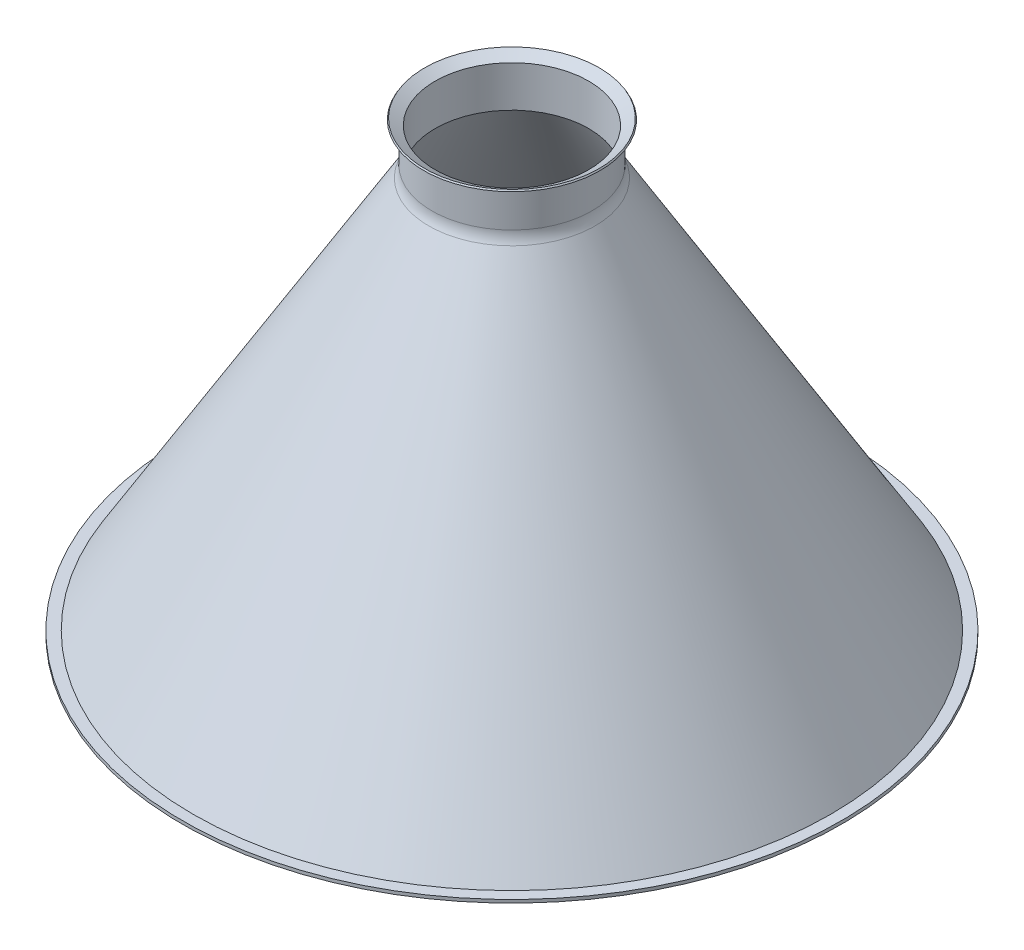
ISO-10303-21;
HEADER;
FILE_DESCRIPTION(('STEP AP214'),'2;1');
FILE_NAME('part.step','',(''),(''),'','','');
FILE_SCHEMA(('AUTOMOTIVE_DESIGN { 1 0 10303 214 1 1 1 1 }'));
ENDSEC;
DATA;
#1=APPLICATION_CONTEXT('core data for automotive mechanical design processes');
#2=APPLICATION_PROTOCOL_DEFINITION('international standard','automotive_design',2000,#1);
#3=PRODUCT_CONTEXT('',#1,'mechanical');
#4=PRODUCT('Part','Part','',(#3));
#5=PRODUCT_RELATED_PRODUCT_CATEGORY('part','',(#4));
#6=PRODUCT_DEFINITION_FORMATION('','',#4);
#7=PRODUCT_DEFINITION_CONTEXT('part definition',#1,'design');
#8=PRODUCT_DEFINITION('design','',#6,#7);
#9=PRODUCT_DEFINITION_SHAPE('','',#8);
#10=(LENGTH_UNIT() NAMED_UNIT(*) SI_UNIT(.MILLI.,.METRE.));
#11=(NAMED_UNIT(*) PLANE_ANGLE_UNIT() SI_UNIT($,.RADIAN.));
#12=(NAMED_UNIT(*) SI_UNIT($,.STERADIAN.) SOLID_ANGLE_UNIT());
#13=UNCERTAINTY_MEASURE_WITH_UNIT(LENGTH_MEASURE(1.E-05),#10,'distance_accuracy_value','');
#14=(GEOMETRIC_REPRESENTATION_CONTEXT(3) GLOBAL_UNCERTAINTY_ASSIGNED_CONTEXT((#13)) GLOBAL_UNIT_ASSIGNED_CONTEXT((#10,
#11,#12)) REPRESENTATION_CONTEXT('',''));
#15=CARTESIAN_POINT('',(0.,0.,0.));
#16=DIRECTION('',(0.,0.,1.));
#17=DIRECTION('',(1.,0.,0.));
#18=AXIS2_PLACEMENT_3D('',#15,#16,#17);
#19=CARTESIAN_POINT('',(0.,74.5394970830572,0.));
#20=DIRECTION('',(0.,1.,0.));
#21=DIRECTION('',(0.,0.,1.));
#22=AXIS2_PLACEMENT_3D('',#19,#20,#21);
#23=CONICAL_SURFACE('',#22,25.2615189104075,1.02957544582547);
#24=CARTESIAN_POINT('',(0.,76.0850453883371,0.));
#25=DIRECTION('',(0.,-1.,0.));
#26=DIRECTION('',(0.,0.,-1.));
#27=AXIS2_PLACEMENT_3D('',#24,#25,#26);
#28=CIRCLE('',#27,27.8327599407364);
#29=CARTESIAN_POINT('',(0.,76.0850453883371,-27.8327599407364));
#30=VERTEX_POINT('',#29);
#31=EDGE_CURVE('E44',#30,#30,#28,.T.);
#32=ORIENTED_EDGE('',*,*,#31,.T.);
#33=EDGE_LOOP('',(#32));
#34=FACE_BOUND('',#33,.T.);
#35=CARTESIAN_POINT('',(0.,74.5394970830572,0.));
#36=DIRECTION('',(0.,-1.,0.));
#37=DIRECTION('',(0.,0.,-1.));
#38=AXIS2_PLACEMENT_3D('',#35,#36,#37);
#39=CIRCLE('',#38,25.2615189104075);
#40=CARTESIAN_POINT('',(0.,74.5394970830572,-25.2615189104075));
#41=VERTEX_POINT('',#40);
#42=EDGE_CURVE('E71',#41,#41,#39,.T.);
#43=ORIENTED_EDGE('',*,*,#42,.F.);
#44=EDGE_LOOP('',(#43));
#45=FACE_BOUND('',#44,.T.);
#46=ADVANCED_FACE('F33',(#34,#45),#23,.T.);
#47=CARTESIAN_POINT('',(0.,76.0850453883371,0.));
#48=DIRECTION('',(0.,-1.,0.));
#49=DIRECTION('',(0.,0.,-1.));
#50=AXIS2_PLACEMENT_3D('',#47,#48,#49);
#51=CONICAL_SURFACE('',#50,27.8327599407364,0.541220880969439);
#52=CARTESIAN_POINT('',(0.,76.526598412436,0.));
#53=DIRECTION('',(0.,-1.,0.));
#54=DIRECTION('',(0.,0.,-1.));
#55=AXIS2_PLACEMENT_3D('',#52,#53,#54);
#56=CIRCLE('',#55,27.5673466558526);
#57=CARTESIAN_POINT('',(0.,76.526598412436,-27.5673466558526));
#58=VERTEX_POINT('',#57);
#59=EDGE_CURVE('E48',#58,#58,#56,.T.);
#60=ORIENTED_EDGE('',*,*,#59,.T.);
#61=EDGE_LOOP('',(#60));
#62=FACE_BOUND('',#61,.T.);
#63=ORIENTED_EDGE('',*,*,#31,.F.);
#64=EDGE_LOOP('',(#63));
#65=FACE_BOUND('',#64,.T.);
#66=ADVANCED_FACE('F78',(#62,#65),#51,.T.);
#67=CARTESIAN_POINT('',(0.,76.526598412436,0.));
#68=DIRECTION('',(0.,1.,0.));
#69=DIRECTION('',(0.,0.,1.));
#70=AXIS2_PLACEMENT_3D('',#67,#68,#69);
#71=CONICAL_SURFACE('',#70,27.5673466558526,1.02957544582547);
#72=CARTESIAN_POINT('',(0.,74.5394970830572,0.));
#73=DIRECTION('',(0.,-1.,0.));
#74=DIRECTION('',(0.,0.,-1.));
#75=AXIS2_PLACEMENT_3D('',#72,#73,#74);
#76=CIRCLE('',#75,24.2615189104075);
#77=CARTESIAN_POINT('',(0.,74.5394970830572,-24.2615189104075));
#78=VERTEX_POINT('',#77);
#79=EDGE_CURVE('E53',#78,#78,#76,.T.);
#80=ORIENTED_EDGE('',*,*,#79,.T.);
#81=EDGE_LOOP('',(#80));
#82=FACE_BOUND('',#81,.T.);
#83=ORIENTED_EDGE('',*,*,#59,.F.);
#84=EDGE_LOOP('',(#83));
#85=FACE_BOUND('',#84,.T.);
#86=ADVANCED_FACE('F83',(#82,#85),#71,.F.);
#87=CARTESIAN_POINT('',(0.,0.,0.));
#88=DIRECTION('',(0.,-1.,0.));
#89=DIRECTION('',(0.,0.,-1.));
#90=AXIS2_PLACEMENT_3D('',#87,#88,#89);
#91=CYLINDRICAL_SURFACE('',#90,24.2615189104075);
#92=CARTESIAN_POINT('',(0.,61.5620816388382,0.));
#93=DIRECTION('',(0.,-1.,0.));
#94=DIRECTION('',(0.,0.,-1.));
#95=AXIS2_PLACEMENT_3D('',#92,#93,#94);
#96=CIRCLE('',#95,24.2615189104075);
#97=CARTESIAN_POINT('',(0.,61.5620816388382,-24.2615189104075));
#98=VERTEX_POINT('',#97);
#99=EDGE_CURVE('E56',#98,#98,#96,.T.);
#100=ORIENTED_EDGE('',*,*,#99,.T.);
#101=EDGE_LOOP('',(#100));
#102=FACE_BOUND('',#101,.T.);
#103=ORIENTED_EDGE('',*,*,#79,.F.);
#104=EDGE_LOOP('',(#103));
#105=FACE_BOUND('',#104,.T.);
#106=ADVANCED_FACE('F89',(#102,#105),#91,.F.);
#107=CARTESIAN_POINT('',(0.,61.5620816388382,0.));
#108=DIRECTION('',(0.,-1.,0.));
#109=DIRECTION('',(0.,0.,-1.));
#110=AXIS2_PLACEMENT_3D('',#107,#108,#109);
#111=CONICAL_SURFACE('',#110,24.2615189104075,0.541220880969428);
#112=CARTESIAN_POINT('',(0.,-64.5435766878914,0.));
#113=DIRECTION('',(0.,-1.,0.));
#114=DIRECTION('',(0.,0.,-1.));
#115=AXIS2_PLACEMENT_3D('',#112,#113,#114);
#116=CIRCLE('',#115,100.062419803838);
#117=CARTESIAN_POINT('',(0.,-64.5435766878914,-100.062419803838));
#118=VERTEX_POINT('',#117);
#119=EDGE_CURVE('E59',#118,#118,#116,.T.);
#120=ORIENTED_EDGE('',*,*,#119,.T.);
#121=EDGE_LOOP('',(#120));
#122=FACE_BOUND('',#121,.T.);
#123=ORIENTED_EDGE('',*,*,#99,.F.);
#124=EDGE_LOOP('',(#123));
#125=FACE_BOUND('',#124,.T.);
#126=ADVANCED_FACE('F93',(#122,#125),#111,.F.);
#127=CARTESIAN_POINT('',(100.062419803838,-64.5435766878914,0.));
#128=DIRECTION('',(0.,-1.,0.));
#129=DIRECTION('',(0.,0.,-1.));
#130=AXIS2_PLACEMENT_3D('',#127,#128,#129);
#131=PLANE('',#130);
#132=CARTESIAN_POINT('',(0.,-64.5435766878914,0.));
#133=DIRECTION('',(0.,-1.,0.));
#134=DIRECTION('',(0.,0.,-1.));
#135=AXIS2_PLACEMENT_3D('',#132,#133,#134);
#136=CIRCLE('',#135,104.062419803838);
#137=CARTESIAN_POINT('',(0.,-64.5435766878914,-104.062419803838));
#138=VERTEX_POINT('',#137);
#139=EDGE_CURVE('E62',#138,#138,#136,.T.);
#140=ORIENTED_EDGE('',*,*,#139,.T.);
#141=EDGE_LOOP('',(#140));
#142=FACE_BOUND('',#141,.T.);
#143=ORIENTED_EDGE('',*,*,#119,.F.);
#144=EDGE_LOOP('',(#143));
#145=FACE_BOUND('',#144,.T.);
#146=ADVANCED_FACE('F97',(#142,#145),#131,.T.);
#147=CARTESIAN_POINT('',(0.,0.,0.));
#148=DIRECTION('',(0.,-1.,0.));
#149=DIRECTION('',(0.,0.,-1.));
#150=AXIS2_PLACEMENT_3D('',#147,#148,#149);
#151=CYLINDRICAL_SURFACE('',#150,104.062419803838);
#152=CARTESIAN_POINT('',(0.,-63.5435766878914,0.));
#153=DIRECTION('',(0.,-1.,0.));
#154=DIRECTION('',(0.,0.,-1.));
#155=AXIS2_PLACEMENT_3D('',#152,#153,#154);
#156=CIRCLE('',#155,104.062419803838);
#157=CARTESIAN_POINT('',(0.,-63.5435766878914,-104.062419803838));
#158=VERTEX_POINT('',#157);
#159=EDGE_CURVE('E65',#158,#158,#156,.T.);
#160=ORIENTED_EDGE('',*,*,#159,.T.);
#161=EDGE_LOOP('',(#160));
#162=FACE_BOUND('',#161,.T.);
#163=ORIENTED_EDGE('',*,*,#139,.F.);
#164=EDGE_LOOP('',(#163));
#165=FACE_BOUND('',#164,.T.);
#166=ADVANCED_FACE('F101',(#162,#165),#151,.T.);
#167=CARTESIAN_POINT('',(104.062419803838,-63.5435766878913,0.));
#168=DIRECTION('',(0.,1.,0.));
#169=DIRECTION('',(0.,0.,1.));
#170=AXIS2_PLACEMENT_3D('',#167,#168,#169);
#171=PLANE('',#170);
#172=CARTESIAN_POINT('',(0.,-63.5435766878913,0.));
#173=DIRECTION('',(0.,-1.,0.));
#174=DIRECTION('',(0.,0.,-1.));
#175=AXIS2_PLACEMENT_3D('',#172,#173,#174);
#176=CIRCLE('',#175,100.628081162522);
#177=CARTESIAN_POINT('',(0.,-63.5435766878913,-100.628081162522));
#178=VERTEX_POINT('',#177);
#179=EDGE_CURVE('E68',#178,#178,#176,.T.);
#180=ORIENTED_EDGE('',*,*,#179,.T.);
#181=EDGE_LOOP('',(#180));
#182=FACE_BOUND('',#181,.T.);
#183=ORIENTED_EDGE('',*,*,#159,.F.);
#184=EDGE_LOOP('',(#183));
#185=FACE_BOUND('',#184,.T.);
#186=ADVANCED_FACE('F105',(#182,#185),#171,.T.);
#187=CARTESIAN_POINT('',(0.,-63.5435766878913,0.));
#188=DIRECTION('',(0.,-1.,0.));
#189=DIRECTION('',(0.,0.,-1.));
#190=AXIS2_PLACEMENT_3D('',#187,#188,#189);
#191=CONICAL_SURFACE('',#190,100.628081162522,0.541220880969428);
#192=CARTESIAN_POINT('',(0.,60.1751258136039,0.));
#193=DIRECTION('',(0.,-1.,0.));
#194=DIRECTION('',(0.,0.,-1.));
#195=AXIS2_PLACEMENT_3D('',#192,#193,#194);
#196=CIRCLE('',#195,26.2619565063069);
#197=CARTESIAN_POINT('',(0.,60.1751258136039,-26.2619565063069));
#198=VERTEX_POINT('',#197);
#199=EDGE_CURVE('E40',#198,#198,#196,.T.);
#200=ORIENTED_EDGE('',*,*,#199,.T.);
#201=EDGE_LOOP('',(#200));
#202=FACE_BOUND('',#201,.T.);
#203=ORIENTED_EDGE('',*,*,#179,.F.);
#204=EDGE_LOOP('',(#203));
#205=FACE_BOUND('',#204,.T.);
#206=ADVANCED_FACE('F109',(#202,#205),#191,.T.);
#207=CARTESIAN_POINT('',(0.,0.,0.));
#208=DIRECTION('',(0.,-1.,0.));
#209=DIRECTION('',(0.,0.,-1.));
#210=AXIS2_PLACEMENT_3D('',#207,#208,#209);
#211=CYLINDRICAL_SURFACE('',#210,25.2615189104075);
#212=CARTESIAN_POINT('',(0.,63.7814051925903,0.));
#213=DIRECTION('',(0.,-1.,0.));
#214=DIRECTION('',(0.,0.,-1.));
#215=AXIS2_PLACEMENT_3D('',#212,#213,#214);
#216=CIRCLE('',#215,25.2615189104075);
#217=CARTESIAN_POINT('',(0.,63.7814051925903,-25.2615189104075));
#218=VERTEX_POINT('',#217);
#219=EDGE_CURVE('E10',#218,#218,#216,.F.);
#220=ORIENTED_EDGE('',*,*,#219,.T.);
#221=EDGE_LOOP('',(#220));
#222=FACE_BOUND('',#221,.T.);
#223=ORIENTED_EDGE('',*,*,#42,.T.);
#224=EDGE_LOOP('',(#223));
#225=FACE_BOUND('',#224,.T.);
#226=ADVANCED_FACE('F75',(#222,#225),#211,.T.);
#227=CARTESIAN_POINT('',(0.,63.7814051925903,0.));
#228=DIRECTION('',(0.,-1.,0.));
#229=DIRECTION('',(0.,0.,-1.));
#230=AXIS2_PLACEMENT_3D('',#227,#228,#229);
#231=TOROIDAL_SURFACE('',#230,32.2615189104075,7.);
#232=ORIENTED_EDGE('',*,*,#219,.F.);
#233=EDGE_LOOP('',(#232));
#234=FACE_BOUND('',#233,.T.);
#235=ORIENTED_EDGE('',*,*,#199,.F.);
#236=EDGE_LOOP('',(#235));
#237=FACE_BOUND('',#236,.T.);
#238=ADVANCED_FACE('F35',(#234,#237),#231,.F.);
#239=CLOSED_SHELL('',(#46,#66,#86,#106,#126,#146,#166,#186,#206,#226,#238));
#240=MANIFOLD_SOLID_BREP('B2',#239);
#241=ADVANCED_BREP_SHAPE_REPRESENTATION('',(#18,#240),#14);
#242=SHAPE_DEFINITION_REPRESENTATION(#9,#241);
ENDSEC;
END-ISO-10303-21;
